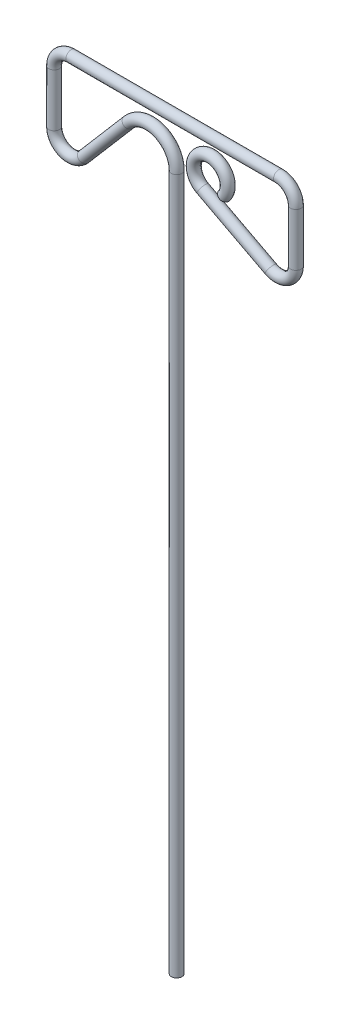
ISO-10303-21;
HEADER;
FILE_DESCRIPTION(('STEP AP214'),'2;1');
FILE_NAME('part.step','',(''),(''),'','','');
FILE_SCHEMA(('AUTOMOTIVE_DESIGN { 1 0 10303 214 1 1 1 1 }'));
ENDSEC;
DATA;
#1=APPLICATION_CONTEXT('core data for automotive mechanical design processes');
#2=APPLICATION_PROTOCOL_DEFINITION('international standard','automotive_design',2000,#1);
#3=PRODUCT_CONTEXT('',#1,'mechanical');
#4=PRODUCT('Part','Part','',(#3));
#5=PRODUCT_RELATED_PRODUCT_CATEGORY('part','',(#4));
#6=PRODUCT_DEFINITION_FORMATION('','',#4);
#7=PRODUCT_DEFINITION_CONTEXT('part definition',#1,'design');
#8=PRODUCT_DEFINITION('design','',#6,#7);
#9=PRODUCT_DEFINITION_SHAPE('','',#8);
#10=(LENGTH_UNIT() NAMED_UNIT(*) SI_UNIT(.MILLI.,.METRE.));
#11=(NAMED_UNIT(*) PLANE_ANGLE_UNIT() SI_UNIT($,.RADIAN.));
#12=(NAMED_UNIT(*) SI_UNIT($,.STERADIAN.) SOLID_ANGLE_UNIT());
#13=UNCERTAINTY_MEASURE_WITH_UNIT(LENGTH_MEASURE(1.E-05),#10,'distance_accuracy_value','');
#14=(GEOMETRIC_REPRESENTATION_CONTEXT(3) GLOBAL_UNCERTAINTY_ASSIGNED_CONTEXT((#13)) GLOBAL_UNIT_ASSIGNED_CONTEXT((#10,
#11,#12)) REPRESENTATION_CONTEXT('',''));
#15=CARTESIAN_POINT('',(0.,0.,0.));
#16=DIRECTION('',(0.,0.,1.));
#17=DIRECTION('',(1.,0.,0.));
#18=AXIS2_PLACEMENT_3D('',#15,#16,#17);
#19=CARTESIAN_POINT('',(0.,0.,0.));
#20=DIRECTION('',(0.,1.,0.));
#21=DIRECTION('',(0.,0.,1.));
#22=AXIS2_PLACEMENT_3D('',#19,#20,#21);
#23=PLANE('',#22);
#24=CARTESIAN_POINT('',(0.,0.,0.));
#25=DIRECTION('',(0.,1.,0.));
#26=DIRECTION('',(0.,0.,1.));
#27=AXIS2_PLACEMENT_3D('',#24,#25,#26);
#28=CIRCLE('',#27,0.78);
#29=CARTESIAN_POINT('',(0.,0.,0.78));
#30=VERTEX_POINT('',#29);
#31=EDGE_CURVE('E45',#30,#30,#28,.T.);
#32=ORIENTED_EDGE('',*,*,#31,.F.);
#33=EDGE_LOOP('',(#32));
#34=FACE_BOUND('',#33,.T.);
#35=ADVANCED_FACE('F33',(#34),#23,.F.);
#36=CARTESIAN_POINT('',(7.,102.5,0.));
#37=DIRECTION('',(-0.6,-0.8,0.));
#38=DIRECTION('',(0.,0.,1.));
#39=AXIS2_PLACEMENT_3D('',#36,#37,#38);
#40=PLANE('',#39);
#41=CARTESIAN_POINT('',(7.,102.5,0.));
#42=DIRECTION('',(-0.6,-0.8,0.));
#43=DIRECTION('',(0.,0.,1.));
#44=AXIS2_PLACEMENT_3D('',#41,#42,#43);
#45=CIRCLE('',#44,0.78);
#46=CARTESIAN_POINT('',(7.,102.5,0.78));
#47=VERTEX_POINT('',#46);
#48=EDGE_CURVE('E11',#47,#47,#45,.T.);
#49=ORIENTED_EDGE('',*,*,#48,.T.);
#50=EDGE_LOOP('',(#49));
#51=FACE_BOUND('',#50,.T.);
#52=ADVANCED_FACE('F48',(#51),#40,.T.);
#53=CARTESIAN_POINT('',(0.,0.,0.));
#54=DIRECTION('',(0.,1.,0.));
#55=DIRECTION('',(0.,0.,1.));
#56=AXIS2_PLACEMENT_3D('',#53,#54,#55);
#57=CYLINDRICAL_SURFACE('',#56,0.78);
#58=CARTESIAN_POINT('',(0.,102.186970361805,0.));
#59=DIRECTION('',(0.,1.,0.));
#60=DIRECTION('',(0.,0.,1.));
#61=AXIS2_PLACEMENT_3D('',#58,#59,#60);
#62=CIRCLE('',#61,0.78);
#63=CARTESIAN_POINT('',(0.780000000000006,102.186970361805,0.));
#64=VERTEX_POINT('',#63);
#65=EDGE_CURVE('E86',#64,#64,#62,.T.);
#66=ORIENTED_EDGE('',*,*,#65,.F.);
#67=EDGE_LOOP('',(#66));
#68=FACE_BOUND('',#67,.T.);
#69=ORIENTED_EDGE('',*,*,#31,.T.);
#70=EDGE_LOOP('',(#69));
#71=FACE_BOUND('',#70,.T.);
#72=ADVANCED_FACE('F90',(#68,#71),#57,.T.);
#73=CARTESIAN_POINT('',(-4.,102.186970361805,0.));
#74=DIRECTION('',(0.,0.,1.));
#75=DIRECTION('',(1.,0.,0.));
#76=AXIS2_PLACEMENT_3D('',#73,#74,#75);
#77=TOROIDAL_SURFACE('',#76,4.,0.78);
#78=CARTESIAN_POINT('',(-7.03702640946118,104.790135855629,0.));
#79=DIRECTION('',(-0.650791373455968,-0.759256602365297,0.));
#80=DIRECTION('',(0.,0.,1.));
#81=AXIS2_PLACEMENT_3D('',#78,#79,#80);
#82=CIRCLE('',#81,0.78);
#83=CARTESIAN_POINT('',(-7.62924655930612,105.297753126924,0.));
#84=VERTEX_POINT('',#83);
#85=EDGE_CURVE('E83',#84,#84,#82,.T.);
#86=CARTESIAN_POINT('',(-4.,102.186970361805,0.));
#87=DIRECTION('',(0.,0.,1.));
#88=DIRECTION('',(1.,0.,0.));
#89=AXIS2_PLACEMENT_3D('',#86,#87,#88);
#90=CIRCLE('',#89,4.78);
#91=EDGE_CURVE('',#64,#84,#90,.T.);
#92=ORIENTED_EDGE('',*,*,#65,.T.);
#93=ORIENTED_EDGE('',*,*,#85,.F.);
#94=ORIENTED_EDGE('',*,*,#91,.T.);
#95=ORIENTED_EDGE('',*,*,#91,.F.);
#96=EDGE_LOOP('',(#92,#94,#93,#95));
#97=FACE_BOUND('',#96,.T.);
#98=ADVANCED_FACE('F92',(#97),#77,.T.);
#99=CARTESIAN_POINT('',(-7.03702640946119,104.790135855629,0.));
#100=DIRECTION('',(-0.650791373455968,-0.759256602365297,0.));
#101=DIRECTION('',(0.759256602365297,-0.650791373455968,0.));
#102=AXIS2_PLACEMENT_3D('',#99,#100,#101);
#103=CYLINDRICAL_SURFACE('',#102,0.78);
#104=CARTESIAN_POINT('',(-13.6018584940868,97.1311650902321,0.));
#105=DIRECTION('',(-0.650791373455968,-0.759256602365296,0.));
#106=DIRECTION('',(0.,0.,1.));
#107=AXIS2_PLACEMENT_3D('',#104,#105,#106);
#108=CIRCLE('',#107,0.78);
#109=CARTESIAN_POINT('',(-13.0096383442418,96.6235478189365,0.));
#110=VERTEX_POINT('',#109);
#111=EDGE_CURVE('E80',#110,#110,#108,.T.);
#112=ORIENTED_EDGE('',*,*,#111,.F.);
#113=EDGE_LOOP('',(#112));
#114=FACE_BOUND('',#113,.T.);
#115=ORIENTED_EDGE('',*,*,#85,.T.);
#116=EDGE_LOOP('',(#115));
#117=FACE_BOUND('',#116,.T.);
#118=ADVANCED_FACE('F99',(#114,#117),#103,.T.);
#119=CARTESIAN_POINT('',(-15.5,98.758143523872,0.));
#120=DIRECTION('',(0.,0.,-1.));
#121=DIRECTION('',(-1.,0.,0.));
#122=AXIS2_PLACEMENT_3D('',#119,#120,#121);
#123=TOROIDAL_SURFACE('',#122,2.49999999999998,0.78);
#124=CARTESIAN_POINT('',(-18.,98.758143523872,0.));
#125=DIRECTION('',(0.,1.,0.));
#126=DIRECTION('',(0.,0.,1.));
#127=AXIS2_PLACEMENT_3D('',#124,#125,#126);
#128=CIRCLE('',#127,0.78);
#129=CARTESIAN_POINT('',(-18.78,98.758143523872,0.));
#130=VERTEX_POINT('',#129);
#131=EDGE_CURVE('E77',#130,#130,#128,.T.);
#132=CARTESIAN_POINT('',(-15.5,98.758143523872,0.));
#133=DIRECTION('',(0.,0.,-1.));
#134=DIRECTION('',(-1.,0.,0.));
#135=AXIS2_PLACEMENT_3D('',#132,#133,#134);
#136=CIRCLE('',#135,3.27999999999998);
#137=EDGE_CURVE('',#110,#130,#136,.T.);
#138=ORIENTED_EDGE('',*,*,#111,.T.);
#139=ORIENTED_EDGE('',*,*,#131,.F.);
#140=ORIENTED_EDGE('',*,*,#137,.T.);
#141=ORIENTED_EDGE('',*,*,#137,.F.);
#142=EDGE_LOOP('',(#138,#140,#139,#141));
#143=FACE_BOUND('',#142,.T.);
#144=ADVANCED_FACE('F106',(#143),#123,.T.);
#145=CARTESIAN_POINT('',(-18.,98.758143523872,0.));
#146=DIRECTION('',(0.,1.,0.));
#147=DIRECTION('',(-1.,0.,0.));
#148=AXIS2_PLACEMENT_3D('',#145,#146,#147);
#149=CYLINDRICAL_SURFACE('',#148,0.78);
#150=CARTESIAN_POINT('',(-18.,106.5,0.));
#151=DIRECTION('',(0.,1.,0.));
#152=DIRECTION('',(0.,0.,1.));
#153=AXIS2_PLACEMENT_3D('',#150,#151,#152);
#154=CIRCLE('',#153,0.78);
#155=CARTESIAN_POINT('',(-18.78,106.5,0.));
#156=VERTEX_POINT('',#155);
#157=EDGE_CURVE('E74',#156,#156,#154,.T.);
#158=ORIENTED_EDGE('',*,*,#157,.F.);
#159=EDGE_LOOP('',(#158));
#160=FACE_BOUND('',#159,.T.);
#161=ORIENTED_EDGE('',*,*,#131,.T.);
#162=EDGE_LOOP('',(#161));
#163=FACE_BOUND('',#162,.T.);
#164=ADVANCED_FACE('F110',(#160,#163),#149,.T.);
#165=CARTESIAN_POINT('',(-15.5,106.5,0.));
#166=DIRECTION('',(0.,0.,-1.));
#167=DIRECTION('',(-1.,0.,0.));
#168=AXIS2_PLACEMENT_3D('',#165,#166,#167);
#169=TOROIDAL_SURFACE('',#168,2.49999999999995,0.78);
#170=CARTESIAN_POINT('',(-15.5,109.,0.));
#171=DIRECTION('',(1.,0.,0.));
#172=DIRECTION('',(0.,0.,1.));
#173=AXIS2_PLACEMENT_3D('',#170,#171,#172);
#174=CIRCLE('',#173,0.78);
#175=CARTESIAN_POINT('',(-15.5,109.78,0.));
#176=VERTEX_POINT('',#175);
#177=EDGE_CURVE('E71',#176,#176,#174,.T.);
#178=CARTESIAN_POINT('',(-15.5,106.5,0.));
#179=DIRECTION('',(0.,0.,-1.));
#180=DIRECTION('',(-1.,0.,0.));
#181=AXIS2_PLACEMENT_3D('',#178,#179,#180);
#182=CIRCLE('',#181,3.27999999999995);
#183=EDGE_CURVE('',#156,#176,#182,.T.);
#184=ORIENTED_EDGE('',*,*,#157,.T.);
#185=ORIENTED_EDGE('',*,*,#177,.F.);
#186=ORIENTED_EDGE('',*,*,#183,.T.);
#187=ORIENTED_EDGE('',*,*,#183,.F.);
#188=EDGE_LOOP('',(#184,#186,#185,#187));
#189=FACE_BOUND('',#188,.T.);
#190=ADVANCED_FACE('F114',(#189),#169,.T.);
#191=CARTESIAN_POINT('',(-15.5,109.,0.));
#192=DIRECTION('',(1.,0.,0.));
#193=DIRECTION('',(0.,0.,-1.));
#194=AXIS2_PLACEMENT_3D('',#191,#192,#193);
#195=CYLINDRICAL_SURFACE('',#194,0.78);
#196=CARTESIAN_POINT('',(15.,109.,0.));
#197=DIRECTION('',(1.,0.,0.));
#198=DIRECTION('',(0.,0.,1.));
#199=AXIS2_PLACEMENT_3D('',#196,#197,#198);
#200=CIRCLE('',#199,0.78);
#201=CARTESIAN_POINT('',(15.,109.78,0.));
#202=VERTEX_POINT('',#201);
#203=EDGE_CURVE('E68',#202,#202,#200,.T.);
#204=ORIENTED_EDGE('',*,*,#203,.F.);
#205=EDGE_LOOP('',(#204));
#206=FACE_BOUND('',#205,.T.);
#207=ORIENTED_EDGE('',*,*,#177,.T.);
#208=EDGE_LOOP('',(#207));
#209=FACE_BOUND('',#208,.T.);
#210=ADVANCED_FACE('F118',(#206,#209),#195,.T.);
#211=CARTESIAN_POINT('',(15.,106.5,0.));
#212=DIRECTION('',(0.,0.,-1.));
#213=DIRECTION('',(-1.,0.,0.));
#214=AXIS2_PLACEMENT_3D('',#211,#212,#213);
#215=TOROIDAL_SURFACE('',#214,2.5,0.78);
#216=CARTESIAN_POINT('',(17.5,106.5,0.));
#217=DIRECTION('',(0.,-1.,0.));
#218=DIRECTION('',(0.,0.,1.));
#219=AXIS2_PLACEMENT_3D('',#216,#217,#218);
#220=CIRCLE('',#219,0.78);
#221=CARTESIAN_POINT('',(18.28,106.5,0.));
#222=VERTEX_POINT('',#221);
#223=EDGE_CURVE('E65',#222,#222,#220,.T.);
#224=CARTESIAN_POINT('',(15.,106.5,0.));
#225=DIRECTION('',(0.,0.,-1.));
#226=DIRECTION('',(-1.,0.,0.));
#227=AXIS2_PLACEMENT_3D('',#224,#225,#226);
#228=CIRCLE('',#227,3.28);
#229=EDGE_CURVE('',#202,#222,#228,.T.);
#230=ORIENTED_EDGE('',*,*,#203,.T.);
#231=ORIENTED_EDGE('',*,*,#223,.F.);
#232=ORIENTED_EDGE('',*,*,#229,.T.);
#233=ORIENTED_EDGE('',*,*,#229,.F.);
#234=EDGE_LOOP('',(#230,#232,#231,#233));
#235=FACE_BOUND('',#234,.T.);
#236=ADVANCED_FACE('F122',(#235),#215,.T.);
#237=CARTESIAN_POINT('',(17.5,106.5,0.));
#238=DIRECTION('',(0.,-1.,0.));
#239=DIRECTION('',(0.,0.,-1.));
#240=AXIS2_PLACEMENT_3D('',#237,#238,#239);
#241=CYLINDRICAL_SURFACE('',#240,0.78);
#242=CARTESIAN_POINT('',(17.5,98.758143523872,0.));
#243=DIRECTION('',(0.,-1.,0.));
#244=DIRECTION('',(0.,0.,1.));
#245=AXIS2_PLACEMENT_3D('',#242,#243,#244);
#246=CIRCLE('',#245,0.78);
#247=CARTESIAN_POINT('',(18.28,98.758143523872,0.));
#248=VERTEX_POINT('',#247);
#249=EDGE_CURVE('E60',#248,#248,#246,.T.);
#250=ORIENTED_EDGE('',*,*,#249,.F.);
#251=EDGE_LOOP('',(#250));
#252=FACE_BOUND('',#251,.T.);
#253=ORIENTED_EDGE('',*,*,#223,.T.);
#254=EDGE_LOOP('',(#253));
#255=FACE_BOUND('',#254,.T.);
#256=ADVANCED_FACE('F126',(#252,#255),#241,.T.);
#257=CARTESIAN_POINT('',(15.,98.758143523872,0.));
#258=DIRECTION('',(0.,0.,-1.));
#259=DIRECTION('',(-1.,0.,0.));
#260=AXIS2_PLACEMENT_3D('',#257,#258,#259);
#261=TOROIDAL_SURFACE('',#260,2.49999999999999,0.78);
#262=CARTESIAN_POINT('',(13.8393290465406,96.5439071006788,0.));
#263=DIRECTION('',(-0.8856945692773,0.464268381383762,0.));
#264=DIRECTION('',(0.,0.,1.));
#265=AXIS2_PLACEMENT_3D('',#262,#263,#264);
#266=CIRCLE('',#265,0.78);
#267=CARTESIAN_POINT('',(13.4771997090613,95.8530653366425,0.));
#268=VERTEX_POINT('',#267);
#269=EDGE_CURVE('E58',#268,#268,#266,.T.);
#270=CARTESIAN_POINT('',(15.,98.758143523872,0.));
#271=DIRECTION('',(0.,0.,-1.));
#272=DIRECTION('',(-1.,0.,0.));
#273=AXIS2_PLACEMENT_3D('',#270,#271,#272);
#274=CIRCLE('',#273,3.27999999999999);
#275=EDGE_CURVE('',#248,#268,#274,.T.);
#276=ORIENTED_EDGE('',*,*,#249,.T.);
#277=ORIENTED_EDGE('',*,*,#269,.F.);
#278=ORIENTED_EDGE('',*,*,#275,.T.);
#279=ORIENTED_EDGE('',*,*,#275,.F.);
#280=EDGE_LOOP('',(#276,#278,#277,#279));
#281=FACE_BOUND('',#280,.T.);
#282=ADVANCED_FACE('F130',(#281),#261,.T.);
#283=CARTESIAN_POINT('',(13.8393290465406,96.5439071006788,0.));
#284=DIRECTION('',(-0.885694569277302,0.464268381383758,0.));
#285=DIRECTION('',(-0.464268381383758,-0.885694569277302,0.));
#286=AXIS2_PLACEMENT_3D('',#283,#284,#285);
#287=CYLINDRICAL_SURFACE('',#286,0.78);
#288=CARTESIAN_POINT('',(3.8393290465406,101.785763576807,0.));
#289=DIRECTION('',(-0.885694569277302,0.464268381383758,0.));
#290=DIRECTION('',(0.,0.,1.));
#291=AXIS2_PLACEMENT_3D('',#288,#289,#290);
#292=CIRCLE('',#291,0.78);
#293=CARTESIAN_POINT('',(3.8393290465406,101.785763576807,0.78));
#294=VERTEX_POINT('',#293);
#295=EDGE_CURVE('E40',#294,#294,#292,.T.);
#296=ORIENTED_EDGE('',*,*,#295,.F.);
#297=EDGE_LOOP('',(#296));
#298=FACE_BOUND('',#297,.T.);
#299=ORIENTED_EDGE('',*,*,#269,.T.);
#300=EDGE_LOOP('',(#299));
#301=FACE_BOUND('',#300,.T.);
#302=ADVANCED_FACE('F53',(#298,#301),#287,.T.);
#303=CARTESIAN_POINT('',(5.,104.,0.));
#304=DIRECTION('',(0.,0.,-1.));
#305=DIRECTION('',(-1.,0.,0.));
#306=AXIS2_PLACEMENT_3D('',#303,#304,#305);
#307=TOROIDAL_SURFACE('',#306,2.5,0.78);
#308=ORIENTED_EDGE('',*,*,#48,.F.);
#309=EDGE_LOOP('',(#308));
#310=FACE_BOUND('',#309,.T.);
#311=ORIENTED_EDGE('',*,*,#295,.T.);
#312=EDGE_LOOP('',(#311));
#313=FACE_BOUND('',#312,.T.);
#314=ADVANCED_FACE('F50',(#310,#313),#307,.T.);
#315=CLOSED_SHELL('',(#35,#52,#72,#98,#118,#144,#164,#190,#210,#236,#256,#282,#302,#314));
#316=MANIFOLD_SOLID_BREP('B2',#315);
#317=ADVANCED_BREP_SHAPE_REPRESENTATION('',(#18,#316),#14);
#318=SHAPE_DEFINITION_REPRESENTATION(#9,#317);
ENDSEC;
END-ISO-10303-21;
